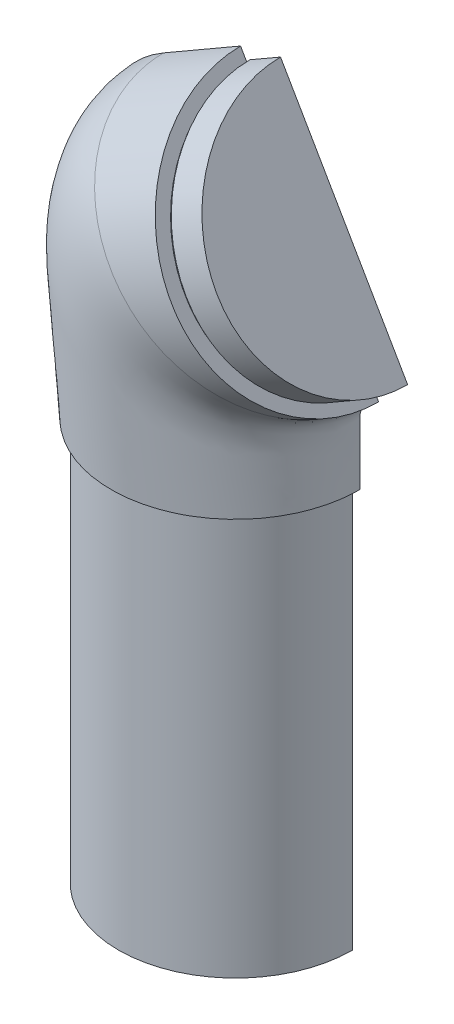
ISO-10303-21;
HEADER;
FILE_DESCRIPTION(('STEP AP214'),'2;1');
FILE_NAME('part.step','',(''),(''),'','','');
FILE_SCHEMA(('AUTOMOTIVE_DESIGN { 1 0 10303 214 1 1 1 1 }'));
ENDSEC;
DATA;
#1=APPLICATION_CONTEXT('core data for automotive mechanical design processes');
#2=APPLICATION_PROTOCOL_DEFINITION('international standard','automotive_design',2000,#1);
#3=PRODUCT_CONTEXT('',#1,'mechanical');
#4=PRODUCT('Part','Part','',(#3));
#5=PRODUCT_RELATED_PRODUCT_CATEGORY('part','',(#4));
#6=PRODUCT_DEFINITION_FORMATION('','',#4);
#7=PRODUCT_DEFINITION_CONTEXT('part definition',#1,'design');
#8=PRODUCT_DEFINITION('design','',#6,#7);
#9=PRODUCT_DEFINITION_SHAPE('','',#8);
#10=(LENGTH_UNIT() NAMED_UNIT(*) SI_UNIT(.MILLI.,.METRE.));
#11=(NAMED_UNIT(*) PLANE_ANGLE_UNIT() SI_UNIT($,.RADIAN.));
#12=(NAMED_UNIT(*) SI_UNIT($,.STERADIAN.) SOLID_ANGLE_UNIT());
#13=UNCERTAINTY_MEASURE_WITH_UNIT(LENGTH_MEASURE(1.E-05),#10,'distance_accuracy_value','');
#14=(GEOMETRIC_REPRESENTATION_CONTEXT(3) GLOBAL_UNCERTAINTY_ASSIGNED_CONTEXT((#13)) GLOBAL_UNIT_ASSIGNED_CONTEXT((#10,
#11,#12)) REPRESENTATION_CONTEXT('',''));
#15=CARTESIAN_POINT('',(0.,0.,0.));
#16=DIRECTION('',(0.,0.,1.));
#17=DIRECTION('',(1.,0.,0.));
#18=AXIS2_PLACEMENT_3D('',#15,#16,#17);
#19=CARTESIAN_POINT('',(0.,0.,0.));
#20=DIRECTION('',(0.,0.,1.));
#21=DIRECTION('',(1.,0.,0.));
#22=AXIS2_PLACEMENT_3D('',#19,#20,#21);
#23=PLANE('',#22);
#24=DIRECTION('',(-1.,0.,0.));
#25=VECTOR('',#24,1.);
#26=CARTESIAN_POINT('',(0.,0.,0.));
#27=LINE('',#26,#25);
#28=CARTESIAN_POINT('',(52.9,0.,0.));
#29=VERTEX_POINT('',#28);
#30=CARTESIAN_POINT('',(-52.9,0.,0.));
#31=VERTEX_POINT('',#30);
#32=EDGE_CURVE('E287',#29,#31,#27,.T.);
#33=ORIENTED_EDGE('',*,*,#32,.T.);
#34=DIRECTION('',(0.,-1.,0.));
#35=VECTOR('',#34,1.);
#36=CARTESIAN_POINT('',(-52.9,0.,0.));
#37=LINE('',#36,#35);
#38=CARTESIAN_POINT('',(-52.9,179.8,0.));
#39=VERTEX_POINT('',#38);
#40=EDGE_CURVE('E292',#31,#39,#37,.F.);
#41=ORIENTED_EDGE('',*,*,#40,.T.);
#42=DIRECTION('',(1.,0.,0.));
#43=VECTOR('',#42,1.);
#44=CARTESIAN_POINT('',(52.9,179.8,0.));
#45=LINE('',#44,#43);
#46=CARTESIAN_POINT('',(-49.9408100461428,179.8,0.));
#47=VERTEX_POINT('',#46);
#48=EDGE_CURVE('E289',#39,#47,#45,.T.);
#49=ORIENTED_EDGE('',*,*,#48,.T.);
#50=DIRECTION('',(0.,-1.,0.));
#51=VECTOR('',#50,1.);
#52=CARTESIAN_POINT('',(-49.9408100461428,0.,0.));
#53=LINE('',#52,#51);
#54=CARTESIAN_POINT('',(-49.9408100461428,182.,0.));
#55=VERTEX_POINT('',#54);
#56=EDGE_CURVE('E57',#47,#55,#53,.F.);
#57=ORIENTED_EDGE('',*,*,#56,.T.);
#58=DIRECTION('',(1.,0.,0.));
#59=VECTOR('',#58,1.);
#60=CARTESIAN_POINT('',(0.,182.,0.));
#61=LINE('',#60,#59);
#62=CARTESIAN_POINT('',(-56.2,182.,0.));
#63=VERTEX_POINT('',#62);
#64=EDGE_CURVE('E65',#55,#63,#61,.F.);
#65=ORIENTED_EDGE('',*,*,#64,.T.);
#66=CARTESIAN_POINT('',(-32.4981395853635,308.709284743092,0.));
#67=CARTESIAN_POINT('',(-43.684502388916,302.250835167208,0.));
#68=CARTESIAN_POINT('',(-52.2381402305011,292.522347205976,0.));
#69=CARTESIAN_POINT('',(-61.3670572465941,272.053546862939,0.));
#70=CARTESIAN_POINT('',(-63.1747268607098,261.882397167296,0.));
#71=CARTESIAN_POINT('',(-60.2471567425906,228.352579644533,0.));
#72=CARTESIAN_POINT('',(-58.2235783712953,205.176289822267,0.));
#73=CARTESIAN_POINT('',(-56.2,182.,0.));
#74=B_SPLINE_CURVE_WITH_KNOTS('',3,(#66,#67,#68,#69,#70,#71,#72,#73),.UNSPECIFIED.,.F.,.F.,(4,2,
2,4),(0.,0.277339745650844,0.500486887933144,1.),.UNSPECIFIED.);
#75=CARTESIAN_POINT('',(-62.2707351138858,251.5288694668,0.));
#76=VERTEX_POINT('',#75);
#77=EDGE_CURVE('E247',#76,#63,#74,.T.);
#78=ORIENTED_EDGE('',*,*,#77,.F.);
#79=CARTESIAN_POINT('',(-32.4981395853635,308.709284743092,0.));
#80=CARTESIAN_POINT('',(-43.684502388916,302.250835167208,0.));
#81=CARTESIAN_POINT('',(-52.2381402305011,292.522347205976,0.));
#82=CARTESIAN_POINT('',(-61.3670572465941,272.053546862939,0.));
#83=CARTESIAN_POINT('',(-63.1747268607098,261.882397167296,0.));
#84=CARTESIAN_POINT('',(-60.2471567425906,228.352579644533,0.));
#85=CARTESIAN_POINT('',(-58.2235783712953,205.176289822267,0.));
#86=CARTESIAN_POINT('',(-56.2,182.,0.));
#87=B_SPLINE_CURVE_WITH_KNOTS('',3,(#79,#80,#81,#82,#83,#84,#85,#86),.UNSPECIFIED.,.F.,.F.,(4,2,
2,4),(0.,0.277339745650844,0.500486887933144,1.),.UNSPECIFIED.);
#88=CARTESIAN_POINT('',(-32.4981395853636,308.709284743092,0.));
#89=VERTEX_POINT('',#88);
#90=EDGE_CURVE('E245',#89,#76,#87,.T.);
#91=ORIENTED_EDGE('',*,*,#90,.F.);
#92=DIRECTION('',(-0.866025403784437,-0.500000000000003,0.));
#93=VECTOR('',#92,1.);
#94=CARTESIAN_POINT('',(-81.7044641670906,280.3,0.));
#95=LINE('',#94,#93);
#96=CARTESIAN_POINT('',(2.29999999999996,328.8,0.));
#97=VERTEX_POINT('',#96);
#98=EDGE_CURVE('E152',#97,#89,#95,.T.);
#99=ORIENTED_EDGE('',*,*,#98,.F.);
#100=DIRECTION('',(-0.500000000000003,0.866025403784437,0.));
#101=VECTOR('',#100,1.);
#102=CARTESIAN_POINT('',(2.29999999999995,328.8,0.));
#103=LINE('',#102,#101);
#104=CARTESIAN_POINT('',(5.4,323.430642496537,0.));
#105=VERTEX_POINT('',#104);
#106=EDGE_CURVE('E163',#105,#97,#103,.T.);
#107=ORIENTED_EDGE('',*,*,#106,.F.);
#108=DIRECTION('',(-0.866025403784437,-0.500000000000003,0.));
#109=VECTOR('',#108,1.);
#110=CARTESIAN_POINT('',(-78.6044641670905,274.930642496536,0.));
#111=LINE('',#110,#109);
#112=CARTESIAN_POINT('',(7.1320508075689,324.430642496536,0.));
#113=VERTEX_POINT('',#112);
#114=EDGE_CURVE('E182',#113,#105,#111,.T.);
#115=ORIENTED_EDGE('',*,*,#114,.F.);
#116=DIRECTION('',(0.500000000000003,-0.866025403784437,0.));
#117=VECTOR('',#116,1.);
#118=CARTESIAN_POINT('',(6.50705080756886,325.513174251267,0.));
#119=LINE('',#118,#117);
#120=CARTESIAN_POINT('',(6.50705080756885,325.513174251267,0.));
#121=VERTEX_POINT('',#120);
#122=EDGE_CURVE('E185',#121,#113,#119,.T.);
#123=ORIENTED_EDGE('',*,*,#122,.F.);
#124=DIRECTION('',(-0.866025403784437,-0.500000000000003,0.));
#125=VECTOR('',#124,1.);
#126=CARTESIAN_POINT('',(-79.2294641670905,276.013174251267,0.));
#127=LINE('',#126,#125);
#128=CARTESIAN_POINT('',(20.3634572681199,333.513174251267,0.));
#129=VERTEX_POINT('',#128);
#130=EDGE_CURVE('E190',#129,#121,#127,.T.);
#131=ORIENTED_EDGE('',*,*,#130,.F.);
#132=DIRECTION('',(-0.500000000000003,0.866025403784437,0.));
#133=VECTOR('',#132,1.);
#134=CARTESIAN_POINT('',(20.3634572681198,333.513174251267,0.));
#135=LINE('',#134,#133);
#136=CARTESIAN_POINT('',(77.8634572681201,233.920252816057,0.));
#137=VERTEX_POINT('',#136);
#138=EDGE_CURVE('E153',#137,#129,#135,.T.);
#139=ORIENTED_EDGE('',*,*,#138,.F.);
#140=DIRECTION('',(-0.866025403784437,-0.500000000000003,0.));
#141=VECTOR('',#140,1.);
#142=CARTESIAN_POINT('',(-21.7294641670903,176.420252816057,0.));
#143=LINE('',#142,#141);
#144=CARTESIAN_POINT('',(64.0070508075691,225.920252816057,0.));
#145=VERTEX_POINT('',#144);
#146=EDGE_CURVE('E187',#145,#137,#143,.F.);
#147=ORIENTED_EDGE('',*,*,#146,.F.);
#148=CARTESIAN_POINT('',(63.3820508075691,227.002784570788,0.));
#149=VERTEX_POINT('',#148);
#150=EDGE_CURVE('E184',#149,#145,#119,.T.);
#151=ORIENTED_EDGE('',*,*,#150,.F.);
#152=DIRECTION('',(-0.866025403784437,-0.500000000000003,0.));
#153=VECTOR('',#152,1.);
#154=CARTESIAN_POINT('',(-22.3544641670903,177.502784570787,0.));
#155=LINE('',#154,#153);
#156=CARTESIAN_POINT('',(61.6500000000002,226.002784570788,0.));
#157=VERTEX_POINT('',#156);
#158=EDGE_CURVE('E159',#157,#149,#155,.F.);
#159=ORIENTED_EDGE('',*,*,#158,.F.);
#160=CARTESIAN_POINT('',(64.7500000000003,220.633427067324,0.));
#161=VERTEX_POINT('',#160);
#162=EDGE_CURVE('E156',#161,#157,#103,.T.);
#163=ORIENTED_EDGE('',*,*,#162,.F.);
#164=DIRECTION('',(-0.866025403784437,-0.500000000000003,0.));
#165=VECTOR('',#164,1.);
#166=CARTESIAN_POINT('',(-19.2544641670902,172.133427067324,0.));
#167=LINE('',#166,#165);
#168=CARTESIAN_POINT('',(61.2,218.583833611701,0.));
#169=VERTEX_POINT('',#168);
#170=EDGE_CURVE('E141',#169,#161,#167,.F.);
#171=ORIENTED_EDGE('',*,*,#170,.F.);
#172=CARTESIAN_POINT('',(56.2,182.,0.));
#173=CARTESIAN_POINT('',(56.2,188.433725967834,0.));
#174=CARTESIAN_POINT('',(56.2,194.867451935668,0.));
#175=CARTESIAN_POINT('',(56.2,204.17531179362,0.));
#176=CARTESIAN_POINT('',(56.1999999999999,207.049445683738,0.));
#177=CARTESIAN_POINT('',(56.2000000000001,213.495713879047,0.));
#178=CARTESIAN_POINT('',(58.1064409459754,216.797766459106,0.));
#179=CARTESIAN_POINT('',(61.2,218.583833611701,0.));
#180=B_SPLINE_CURVE_WITH_KNOTS('',3,(#172,#173,#174,#175,#176,#177,#178,#179),.UNSPECIFIED.,.F.,
.F.,(4,2,2,4),(0.,0.499513112066856,0.722660254349156,1.),.UNSPECIFIED.);
#181=CARTESIAN_POINT('',(56.2,209.923579573856,0.));
#182=VERTEX_POINT('',#181);
#183=EDGE_CURVE('E243',#182,#169,#180,.T.);
#184=ORIENTED_EDGE('',*,*,#183,.F.);
#185=CARTESIAN_POINT('',(56.2,182.,0.));
#186=CARTESIAN_POINT('',(56.2,188.433725967834,0.));
#187=CARTESIAN_POINT('',(56.2,194.867451935668,0.));
#188=CARTESIAN_POINT('',(56.2,204.17531179362,0.));
#189=CARTESIAN_POINT('',(56.1999999999999,207.049445683738,0.));
#190=CARTESIAN_POINT('',(56.2000000000001,213.495713879047,0.));
#191=CARTESIAN_POINT('',(58.1064409459754,216.797766459106,0.));
#192=CARTESIAN_POINT('',(61.2,218.583833611701,0.));
#193=B_SPLINE_CURVE_WITH_KNOTS('',3,(#185,#186,#187,#188,#189,#190,#191,#192),.UNSPECIFIED.,.F.,
.F.,(4,2,2,4),(0.,0.499513112066856,0.722660254349156,1.),.UNSPECIFIED.);
#194=CARTESIAN_POINT('',(56.2,182.,0.));
#195=VERTEX_POINT('',#194);
#196=EDGE_CURVE('E240',#195,#182,#193,.T.);
#197=ORIENTED_EDGE('',*,*,#196,.F.);
#198=CARTESIAN_POINT('',(56.2,182.,0.));
#199=DIRECTION('',(-1.,0.,0.));
#200=VECTOR('',#199,1.);
#201=LINE('',#198,#200);
#202=CARTESIAN_POINT('',(49.9408100461428,182.,0.));
#203=VERTEX_POINT('',#202);
#204=EDGE_CURVE('E234',#195,#203,#201,.T.);
#205=ORIENTED_EDGE('',*,*,#204,.T.);
#206=DIRECTION('',(0.,-1.,0.));
#207=VECTOR('',#206,1.);
#208=CARTESIAN_POINT('',(49.9408100461428,0.,0.));
#209=LINE('',#208,#207);
#210=CARTESIAN_POINT('',(49.9408100461428,179.8,0.));
#211=VERTEX_POINT('',#210);
#212=EDGE_CURVE('E13',#203,#211,#209,.T.);
#213=ORIENTED_EDGE('',*,*,#212,.T.);
#214=CARTESIAN_POINT('',(52.9,179.8,0.));
#215=VERTEX_POINT('',#214);
#216=EDGE_CURVE('E73',#211,#215,#45,.T.);
#217=ORIENTED_EDGE('',*,*,#216,.T.);
#218=DIRECTION('',(0.,-1.,0.));
#219=VECTOR('',#218,1.);
#220=CARTESIAN_POINT('',(52.9,0.,0.));
#221=LINE('',#220,#219);
#222=EDGE_CURVE('E290',#215,#29,#221,.T.);
#223=ORIENTED_EDGE('',*,*,#222,.T.);
#224=EDGE_LOOP('',(#33,#41,#49,#57,#65,#78,#91,#99,#107,#115,#123,#131,#139,#147,#151,#159,#163,
#171,#184,#197,#205,#213,#217,#223));
#225=FACE_BOUND('',#224,.T.);
#226=ADVANCED_FACE('F48',(#225),#23,.F.);
#227=CARTESIAN_POINT('',(0.,0.,0.));
#228=DIRECTION('',(0.,-1.,0.));
#229=DIRECTION('',(0.,0.,-1.));
#230=AXIS2_PLACEMENT_3D('',#227,#228,#229);
#231=PLANE('',#230);
#232=ORIENTED_EDGE('',*,*,#32,.F.);
#233=CARTESIAN_POINT('',(0.,0.,0.));
#234=DIRECTION('',(0.,-1.,0.));
#235=DIRECTION('',(0.,0.,-1.));
#236=AXIS2_PLACEMENT_3D('',#233,#234,#235);
#237=CIRCLE('',#236,52.9);
#238=EDGE_CURVE('E280',#29,#31,#237,.T.);
#239=ORIENTED_EDGE('',*,*,#238,.T.);
#240=EDGE_LOOP('',(#232,#239));
#241=FACE_BOUND('',#240,.T.);
#242=ADVANCED_FACE('F215',(#241),#231,.T.);
#243=CARTESIAN_POINT('',(0.,0.,0.));
#244=DIRECTION('',(0.,-1.,0.));
#245=DIRECTION('',(0.,0.,-1.));
#246=AXIS2_PLACEMENT_3D('',#243,#244,#245);
#247=CYLINDRICAL_SURFACE('',#246,52.9);
#248=ORIENTED_EDGE('',*,*,#40,.F.);
#249=ORIENTED_EDGE('',*,*,#238,.F.);
#250=ORIENTED_EDGE('',*,*,#222,.F.);
#251=CARTESIAN_POINT('',(0.,179.8,0.));
#252=DIRECTION('',(0.,-1.,0.));
#253=DIRECTION('',(0.,0.,-1.));
#254=AXIS2_PLACEMENT_3D('',#251,#252,#253);
#255=CIRCLE('',#254,52.9);
#256=EDGE_CURVE('E277',#215,#39,#255,.T.);
#257=ORIENTED_EDGE('',*,*,#256,.T.);
#258=EDGE_LOOP('',(#248,#249,#250,#257));
#259=FACE_BOUND('',#258,.T.);
#260=ADVANCED_FACE('F299',(#259),#247,.T.);
#261=CARTESIAN_POINT('',(52.9,179.8,0.));
#262=DIRECTION('',(0.,1.,0.));
#263=DIRECTION('',(0.,0.,1.));
#264=AXIS2_PLACEMENT_3D('',#261,#262,#263);
#265=PLANE('',#264);
#266=ORIENTED_EDGE('',*,*,#48,.F.);
#267=ORIENTED_EDGE('',*,*,#256,.F.);
#268=ORIENTED_EDGE('',*,*,#216,.F.);
#269=CARTESIAN_POINT('',(0.,179.8,0.));
#270=DIRECTION('',(0.,-1.,0.));
#271=DIRECTION('',(0.,0.,-1.));
#272=AXIS2_PLACEMENT_3D('',#269,#270,#271);
#273=CIRCLE('',#272,49.9408100461428);
#274=EDGE_CURVE('E275',#211,#47,#273,.T.);
#275=ORIENTED_EDGE('',*,*,#274,.T.);
#276=EDGE_LOOP('',(#266,#267,#268,#275));
#277=FACE_BOUND('',#276,.T.);
#278=ADVANCED_FACE('F297',(#277),#265,.T.);
#279=CARTESIAN_POINT('',(0.,0.,0.));
#280=DIRECTION('',(0.,-1.,0.));
#281=DIRECTION('',(0.,0.,-1.));
#282=AXIS2_PLACEMENT_3D('',#279,#280,#281);
#283=CYLINDRICAL_SURFACE('',#282,49.9408100461428);
#284=ORIENTED_EDGE('',*,*,#56,.F.);
#285=ORIENTED_EDGE('',*,*,#274,.F.);
#286=ORIENTED_EDGE('',*,*,#212,.F.);
#287=CARTESIAN_POINT('',(0.,182.,0.));
#288=DIRECTION('',(0.,-1.,0.));
#289=DIRECTION('',(0.,0.,-1.));
#290=AXIS2_PLACEMENT_3D('',#287,#288,#289);
#291=CIRCLE('',#290,49.9408100461428);
#292=EDGE_CURVE('E238',#203,#55,#291,.T.);
#293=ORIENTED_EDGE('',*,*,#292,.T.);
#294=EDGE_LOOP('',(#284,#285,#286,#293));
#295=FACE_BOUND('',#294,.T.);
#296=ADVANCED_FACE('F214',(#295),#283,.T.);
#297=CARTESIAN_POINT('',(0.,182.,0.));
#298=DIRECTION('',(0.,1.,0.));
#299=DIRECTION('',(0.,0.,1.));
#300=AXIS2_PLACEMENT_3D('',#297,#298,#299);
#301=PLANE('',#300);
#302=ORIENTED_EDGE('',*,*,#292,.F.);
#303=ORIENTED_EDGE('',*,*,#204,.F.);
#304=CARTESIAN_POINT('',(-56.2,182.,0.));
#305=CARTESIAN_POINT('',(-56.2000419790112,182.,1.05362781943592));
#306=CARTESIAN_POINT('',(-56.1704109403865,182.,2.10725513481555));
#307=CARTESIAN_POINT('',(-56.0520082118276,182.,4.21112491673496));
#308=CARTESIAN_POINT('',(-55.9632396953049,182.,5.261367561863));
#309=CARTESIAN_POINT('',(-55.7267697254406,182.,7.35517696486038));
#310=CARTESIAN_POINT('',(-55.5790694532196,182.,8.39874385610049));
#311=CARTESIAN_POINT('',(-55.2253387751618,182.,10.4752049981828));
#312=CARTESIAN_POINT('',(-55.0193485566867,182.,11.5081060956761));
#313=CARTESIAN_POINT('',(-54.5496616794257,182.,13.5606939172889));
#314=CARTESIAN_POINT('',(-54.2859655278743,182.,14.5803807574781));
#315=CARTESIAN_POINT('',(-53.701719967143,182.,16.6033299112941));
#316=CARTESIAN_POINT('',(-53.3811707763197,182.,17.6065922879867));
#317=CARTESIAN_POINT('',(-52.6840632209159,182.,19.5940513208761));
#318=CARTESIAN_POINT('',(-52.3074758621957,182.,20.5782378074909));
#319=CARTESIAN_POINT('',(-51.4996055603357,182.,22.5239131541039));
#320=CARTESIAN_POINT('',(-51.0683219436696,182.,23.4854017344284));
#321=CARTESIAN_POINT('',(-50.1524160738579,182.,25.3826340243548));
#322=CARTESIAN_POINT('',(-49.6677938361401,182.,26.318377741403));
#323=CARTESIAN_POINT('',(-48.6468418841803,182.,28.1609574766155));
#324=CARTESIAN_POINT('',(-48.1105224311597,182.,29.0677991840967));
#325=CARTESIAN_POINT('',(-46.9877269003883,182.,30.849953297122));
#326=CARTESIAN_POINT('',(-46.4012509629416,182.,31.7252657908539));
#327=CARTESIAN_POINT('',(-45.485438323586,182.,33.012324423233));
#328=CARTESIAN_POINT('',(-45.1741535283962,182.,33.4370224402427));
#329=CARTESIAN_POINT('',(-44.539694453636,182.,34.2775961507915));
#330=CARTESIAN_POINT('',(-44.216517571751,182.,34.6934698815653));
#331=CARTESIAN_POINT('',(-43.3941738645376,182.,35.7215088451537));
#332=CARTESIAN_POINT('',(-42.8877659575935,182.,36.3279115685137));
#333=CARTESIAN_POINT('',(-41.8498277668219,182.,37.5188506484814));
#334=CARTESIAN_POINT('',(-41.3182938764645,182.,38.1033838442799));
#335=CARTESIAN_POINT('',(-39.6873230063346,182.,39.8227212801987));
#336=CARTESIAN_POINT('',(-38.5513574908361,182.,40.9234624962857));
#337=CARTESIAN_POINT('',(-36.7812807476143,182.,42.4995811471067));
#338=CARTESIAN_POINT('',(-36.1800894506995,182.,43.0125633368406));
#339=CARTESIAN_POINT('',(-34.9567230588494,182.,44.0126185209007));
#340=CARTESIAN_POINT('',(-34.3345539447987,182.,44.499698799622));
#341=CARTESIAN_POINT('',(-33.0701629607382,182.,45.4472227073932));
#342=CARTESIAN_POINT('',(-32.427939095523,182.,45.9076636730701));
#343=CARTESIAN_POINT('',(-31.1246386440214,182.,46.8010602206081));
#344=CARTESIAN_POINT('',(-30.4635606610362,182.,47.234013758517));
#345=CARTESIAN_POINT('',(-28.4540135674134,182.,48.4903174060614));
#346=CARTESIAN_POINT('',(-27.0787896822933,182.,49.2714414102739));
#347=CARTESIAN_POINT('',(-24.2676214483973,182.,50.7149844095023));
#348=CARTESIAN_POINT('',(-22.831676799033,182.,51.3774028168002));
#349=CARTESIAN_POINT('',(-19.909152302572,182.,52.5789684765177));
#350=CARTESIAN_POINT('',(-18.4225756650874,182.,53.1181235260757));
#351=CARTESIAN_POINT('',(-15.4093168711974,182.,54.0693122251259));
#352=CARTESIAN_POINT('',(-13.8826349151802,182.,54.4813465096525));
#353=CARTESIAN_POINT('',(-10.7995944577358,182.,55.1754042334872));
#354=CARTESIAN_POINT('',(-9.24322869426606,182.,55.4573954220706));
#355=CARTESIAN_POINT('',(-6.11225786331051,182.,55.8891483969149));
#356=CARTESIAN_POINT('',(-4.53765271262459,182.,56.0389095797593));
#357=CARTESIAN_POINT('',(-1.38139866683656,182.,56.2052662344842));
#358=CARTESIAN_POINT('',(0.200250358499066,182.,56.221859233918));
#359=CARTESIAN_POINT('',(3.35932773463149,182.,56.1218211708624));
#360=CARTESIAN_POINT('',(4.93675609891783,182.,56.0051905346767));
#361=CARTESIAN_POINT('',(8.07580039731675,182.,55.63938147861));
#362=CARTESIAN_POINT('',(9.63741991117926,182.,55.390233782413));
#363=CARTESIAN_POINT('',(12.7341072231026,182.,54.7612272010265));
#364=CARTESIAN_POINT('',(14.2691749998093,182.,54.381368210718));
#365=CARTESIAN_POINT('',(17.3018544757594,182.,53.4937029583323));
#366=CARTESIAN_POINT('',(18.7994662736853,182.,52.9858970333863));
#367=CARTESIAN_POINT('',(21.7466157626231,182.,51.8459866668838));
#368=CARTESIAN_POINT('',(23.1961533635123,182.,51.2138819923251));
#369=CARTESIAN_POINT('',(26.0369646224724,182.,49.8297964629609));
#370=CARTESIAN_POINT('',(27.4282336202787,182.,49.077806042844));
#371=CARTESIAN_POINT('',(30.1424624124138,182.,47.4592791330672));
#372=CARTESIAN_POINT('',(31.465422481779,182.,46.5927431046593));
#373=CARTESIAN_POINT('',(34.0335204267451,182.,44.7512900653049));
#374=CARTESIAN_POINT('',(35.2786624834094,182.,43.7763788850523));
#375=CARTESIAN_POINT('',(37.6823724966599,182.,41.7250844099285));
#376=CARTESIAN_POINT('',(38.8409401177239,182.,40.6487007218337));
#377=CARTESIAN_POINT('',(41.0631333558407,182.,38.4025453798181));
#378=CARTESIAN_POINT('',(42.1267786300155,182.,37.2327931567417));
#379=CARTESIAN_POINT('',(44.1518327271902,182.,34.8076289443206));
#380=CARTESIAN_POINT('',(45.1132413869606,182.,33.5522168182178));
#381=CARTESIAN_POINT('',(46.4734021744832,182.,31.6118212128764));
#382=CARTESIAN_POINT('',(46.913248910338,182.,30.9552728332055));
#383=CARTESIAN_POINT('',(47.7648610045401,182.,29.6242183686922));
#384=CARTESIAN_POINT('',(48.1766284315734,182.,28.9497136118509));
#385=CARTESIAN_POINT('',(48.9713007148927,182.,27.5840306219699));
#386=CARTESIAN_POINT('',(49.3542093239005,182.,26.892854572303));
#387=CARTESIAN_POINT('',(50.0906436903046,182.,25.494822454868));
#388=CARTESIAN_POINT('',(50.4441611294457,182.,24.787962019349));
#389=CARTESIAN_POINT('',(51.4598330331098,182.,22.6453122271065));
#390=CARTESIAN_POINT('',(52.0768797807226,182.,21.1878451202906));
#391=CARTESIAN_POINT('',(53.1858588151865,182.,18.2262110997637));
#392=CARTESIAN_POINT('',(53.677807523799,182.,16.722050344699));
#393=CARTESIAN_POINT('',(54.247797073202,182.,14.6934902333447));
#394=CARTESIAN_POINT('',(54.3830653064413,182.,14.1847177659247));
#395=CARTESIAN_POINT('',(54.6392305717616,182.,13.1636733430544));
#396=CARTESIAN_POINT('',(54.7601308139628,182.,12.6514021964336));
#397=CARTESIAN_POINT('',(55.1011507476817,182.,11.1098511176326));
#398=CARTESIAN_POINT('',(55.2996249619149,182.,10.0757078416209));
#399=CARTESIAN_POINT('',(55.6380587392993,182.,7.99843214273239));
#400=CARTESIAN_POINT('',(55.7780486384135,182.,6.95530466728756));
#401=CARTESIAN_POINT('',(55.9405462012446,182.,5.41810513409839));
#402=CARTESIAN_POINT('',(55.9859786813365,182.,4.92636482817217));
#403=CARTESIAN_POINT('',(56.0638580000222,182.,3.94194713823813));
#404=CARTESIAN_POINT('',(56.0963075627073,182.,3.44926997262397));
#405=CARTESIAN_POINT('',(56.1481702555803,182.,2.46404795122433));
#406=CARTESIAN_POINT('',(56.1676047875762,182.,1.97150421613654));
#407=CARTESIAN_POINT('',(56.1935219443287,182.,0.985974229770951));
#408=CARTESIAN_POINT('',(56.2000018919257,182.,0.492987908084236));
#409=CARTESIAN_POINT('',(56.2,182.,0.));
#410=B_SPLINE_CURVE_WITH_KNOTS('',3,(#304,#305,#306,#307,#308,#309,#310,#311,#312,#313,#314,
#315,#316,#317,#318,#319,#320,#321,#322,#323,#324,#325,#326,#327,#328,#329,#330,#331,#332,#333,
#334,#335,#336,#337,#338,#339,#340,#341,#342,#343,#344,#345,#346,#347,#348,#349,#350,#351,#352,
#353,#354,#355,#356,#357,#358,#359,#360,#361,#362,#363,#364,#365,#366,#367,#368,#369,#370,#371,
#372,#373,#374,#375,#376,#377,#378,#379,#380,#381,#382,#383,#384,#385,#386,#387,#388,#389,#390,
#391,#392,#393,#394,#395,#396,#397,#398,#399,#400,#401,#402,#403,#404,#405,#406,#407,#408,#409),
.UNSPECIFIED.,.F.,.F.,(4,2,2,2,2,2,2,2,2,2,2,2,2,2,2,2,2,2,2,2,2,2,2,2,2,2,2,2,2,2,2,2,2,2,2,2,
2,2,2,2,2,2,2,2,2,2,2,2,2,2,2,2,4),(0.,3.1604657826292,6.32076198327544,9.48099484788836,
12.6390542110523,15.7970858160251,18.9551052921429,22.1147644452426,25.2744625099672,
28.4341596607758,31.5932309393817,34.7522933813239,36.3318002372378,37.9116548123492,
40.2810035218243,42.6506933614176,47.3893102459134,49.7596974913478,52.1294145484864,
54.4993681196928,56.8694977136276,61.6081067164799,66.3467391798026,71.0850718135332,
75.8233807764425,80.562864210219,85.302369271978,90.041962328831,94.781540219454,
99.5200197317994,104.258503054871,108.996973892501,113.73545361264,118.474311590749,
123.213150487021,127.9517345522,132.690336980964,137.427955821653,142.165582226244,
144.53580443655,146.905851836473,149.275590508247,151.645997593686,156.388163500004,
161.129706575097,162.708902882641,164.287745697573,167.445040184973,170.600694936239,
172.082059713835,173.563113506482,175.041725846978,176.520643721961),.UNSPECIFIED.);
#411=EDGE_CURVE('E232',#63,#195,#410,.T.);
#412=ORIENTED_EDGE('',*,*,#411,.F.);
#413=ORIENTED_EDGE('',*,*,#64,.F.);
#414=EDGE_LOOP('',(#302,#303,#412,#413));
#415=FACE_BOUND('',#414,.T.);
#416=ADVANCED_FACE('F210',(#415),#301,.F.);
#417=CARTESIAN_POINT('',(-56.2,182.,0.));
#418=CARTESIAN_POINT('',(-58.2235783712953,205.176289822267,0.));
#419=CARTESIAN_POINT('',(-60.2471567425906,228.352579644533,0.));
#420=CARTESIAN_POINT('',(-63.1747268607098,261.882397167296,0.));
#421=CARTESIAN_POINT('',(-61.3670572465941,272.053546862939,0.));
#422=CARTESIAN_POINT('',(-52.2381402305011,292.522347205976,0.));
#423=CARTESIAN_POINT('',(-43.684502388916,302.250835167208,0.));
#424=CARTESIAN_POINT('',(-32.4981395853635,308.709284743092,0.));
#425=CARTESIAN_POINT('',(-56.2,182.,14.9047449008));
#426=CARTESIAN_POINT('',(-57.795451715433,205.031599628038,15.1807352444374));
#427=CARTESIAN_POINT('',(-59.3909034308661,228.063199256076,15.4567255880747));
#428=CARTESIAN_POINT('',(-61.699090172363,261.383689235603,15.8560089043937));
#429=CARTESIAN_POINT('',(-59.9261356175656,271.50539974931,15.9793018770754));
#430=CARTESIAN_POINT('',(-51.2979606884392,292.058617040046,16.2558302501047));
#431=CARTESIAN_POINT('',(-43.1541789989718,301.945884544331,16.4090656504523));
#432=CARTESIAN_POINT('',(-32.4981395853635,308.709284743092,16.5623010508));
#433=CARTESIAN_POINT('',(-50.2786472938953,182.,29.2001549114727));
#434=CARTESIAN_POINT('',(-51.6100181356908,204.09636240793,29.7408525780157));
#435=CARTESIAN_POINT('',(-52.9413889774863,226.19272481586,30.2815502445587));
#436=CARTESIAN_POINT('',(-54.867522181846,258.160179707752,31.0637934005254));
#437=CARTESIAN_POINT('',(-53.202566743627,267.879290521003,31.3053388899492));
#438=CARTESIAN_POINT('',(-45.2394994827519,287.72483660161,31.8470906195907));
#439=CARTESIAN_POINT('',(-37.5966554694268,297.331956009642,32.1472968598084));
#440=CARTESIAN_POINT('',(-27.5620209697873,303.961379191973,32.4475031000261));
#441=CARTESIAN_POINT('',(-29.2001549114727,182.,50.2786472938953));
#442=CARTESIAN_POINT('',(-30.2592332259483,200.992837973338,51.2096542474942));
#443=CARTESIAN_POINT('',(-31.3183115404239,219.985675946675,52.1406612010932));
#444=CARTESIAN_POINT('',(-32.8505111676724,247.46317110958,53.4875762382276));
#445=CARTESIAN_POINT('',(-31.5158582398189,255.826242962579,53.903484321763));
#446=CARTESIAN_POINT('',(-25.1393743396677,273.020992859167,54.8363062269235));
#447=CARTESIAN_POINT('',(-18.6404694256398,281.383201870272,55.3532200485486));
#448=CARTESIAN_POINT('',(-9.99070850095052,287.060056815323,55.8701338701737));
#449=CARTESIAN_POINT('',(-14.9047449008,182.,56.2));
#450=CARTESIAN_POINT('',(-15.9317381117104,198.939598427537,57.2406523168059));
#451=CARTESIAN_POINT('',(-16.9587313226209,215.879196855074,58.2813046336119));
#452=CARTESIAN_POINT('',(-18.4445124904874,240.386210209666,59.7868468301726));
#453=CARTESIAN_POINT('',(-17.3214979868955,247.847237967224,60.2517367099274));
#454=CARTESIAN_POINT('',(-11.8425697892359,263.21413483829,61.2944177264548));
#455=CARTESIAN_POINT('',(-5.97341127790737,270.675458332733,61.8722088632274));
#456=CARTESIAN_POINT('',(1.92613600625599,275.597598840945,62.45));
#457=CARTESIAN_POINT('',(14.9047449008,182.,56.2));
#458=CARTESIAN_POINT('',(13.9081597404151,194.670417362564,57.2406523168059));
#459=CARTESIAN_POINT('',(12.9115745800303,207.340834725128,58.2813046336119));
#460=CARTESIAN_POINT('',(11.4697856297776,225.67149875125,59.7868468301726));
#461=CARTESIAN_POINT('',(12.1544407403013,231.255754579454,60.2517367099274));
#462=CARTESIAN_POINT('',(15.8044295587348,242.803926246733,61.2944177264548));
#463=CARTESIAN_POINT('',(20.3953498349667,248.373143293581,61.8722088632274));
#464=CARTESIAN_POINT('',(26.7757244083804,251.695519513847,62.45));
#465=CARTESIAN_POINT('',(29.2001549114727,182.,50.2786472938952));
#466=CARTESIAN_POINT('',(28.235654854653,192.617177816763,51.2096542474942));
#467=CARTESIAN_POINT('',(27.2711547978333,203.234355633526,52.1406612010932));
#468=CARTESIAN_POINT('',(25.8757843069625,218.594537851336,53.4875762382276));
#469=CARTESIAN_POINT('',(26.3488009932247,223.276749584099,53.903484321763));
#470=CARTESIAN_POINT('',(29.1012341091667,232.997068225856,54.8363062269235));
#471=CARTESIAN_POINT('',(33.0624079826991,237.665399756042,55.3532200485486));
#472=CARTESIAN_POINT('',(38.692568915587,240.233061539469,55.8701338701737));
#473=CARTESIAN_POINT('',(50.2786472938952,182.,29.2001549114726));
#474=CARTESIAN_POINT('',(49.5864397643955,189.513653382171,29.7408525780157));
#475=CARTESIAN_POINT('',(48.8942322348957,197.027306764342,30.2815502445587));
#476=CARTESIAN_POINT('',(47.8927953211362,207.897529253164,31.0637934005254));
#477=CARTESIAN_POINT('',(48.0355094970328,211.223702025674,31.3053388899492));
#478=CARTESIAN_POINT('',(49.2013592522509,218.293224483413,31.8470906195907));
#479=CARTESIAN_POINT('',(52.0185940264862,221.716645616672,32.1472968598084));
#480=CARTESIAN_POINT('',(56.2638813844237,223.33173916282,32.4475031000262));
#481=CARTESIAN_POINT('',(56.2,182.,14.9047449007999));
#482=CARTESIAN_POINT('',(55.7718733441377,188.578416162063,15.1807352444373));
#483=CARTESIAN_POINT('',(55.3437466882755,195.156832324125,15.4567255880747));
#484=CARTESIAN_POINT('',(54.7243633116532,204.674019725313,15.8560089043937));
#485=CARTESIAN_POINT('',(54.7590783709714,207.597592797367,15.9793018770754));
#486=CARTESIAN_POINT('',(55.2598204579382,213.959444044977,16.2558302501047));
#487=CARTESIAN_POINT('',(57.5761175560312,217.102717081983,16.4090656504523));
#488=CARTESIAN_POINT('',(61.2,218.583833611701,16.5623010508001));
#489=CARTESIAN_POINT('',(56.2,182.,0.));
#490=CARTESIAN_POINT('',(56.2,188.433725967834,0.));
#491=CARTESIAN_POINT('',(56.2,194.867451935668,0.));
#492=CARTESIAN_POINT('',(56.2,204.17531179362,0.));
#493=CARTESIAN_POINT('',(56.1999999999999,207.049445683738,0.));
#494=CARTESIAN_POINT('',(56.2000000000001,213.495713879047,0.));
#495=CARTESIAN_POINT('',(58.1064409459754,216.797766459106,0.));
#496=CARTESIAN_POINT('',(61.2,218.583833611701,0.));
#497=B_SPLINE_SURFACE_WITH_KNOTS('',3,3,((#417,#418,#419,#420,#421,#422,#423,#424),(#425,#426,
#427,#428,#429,#430,#431,#432),(#433,#434,#435,#436,#437,#438,#439,#440),(#441,#442,#443,#444,
#445,#446,#447,#448),(#449,#450,#451,#452,#453,#454,#455,#456),(#457,#458,#459,#460,#461,#462,
#463,#464),(#465,#466,#467,#468,#469,#470,#471,#472),(#473,#474,#475,#476,#477,#478,#479,#480),
(#481,#482,#483,#484,#485,#486,#487,#488),(#489,#490,#491,#492,#493,#494,#495,#496)),
.UNSPECIFIED.,.F.,.F.,.F.,(4,2,2,2,4),(4,2,2,4),(0.,0.25,0.5,0.75,1.),(0.,0.499513112066856,
0.722660254349156,1.),.UNSPECIFIED.);
#498=CARTESIAN_POINT('',(61.2,218.583833611701,0.));
#499=CARTESIAN_POINT('',(61.2,218.583833611701,16.5623010508001));
#500=CARTESIAN_POINT('',(56.2638813844237,223.33173916282,32.4475031000262));
#501=CARTESIAN_POINT('',(38.692568915587,240.233061539469,55.8701338701737));
#502=CARTESIAN_POINT('',(26.7757244083804,251.695519513847,62.45));
#503=CARTESIAN_POINT('',(1.92613600625599,275.597598840945,62.45));
#504=CARTESIAN_POINT('',(-9.99070850095052,287.060056815323,55.8701338701737));
#505=CARTESIAN_POINT('',(-27.5620209697873,303.961379191973,32.4475031000261));
#506=CARTESIAN_POINT('',(-32.4981395853635,308.709284743092,16.5623010508));
#507=CARTESIAN_POINT('',(-32.4981395853635,308.709284743092,0.));
#508=B_SPLINE_CURVE_WITH_KNOTS('',3,(#498,#499,#500,#501,#502,#503,#504,#505,#506,#507),
.UNSPECIFIED.,.F.,.F.,(4,2,2,2,4),(0.,0.25,0.5,0.75,1.),.UNSPECIFIED.);
#509=EDGE_CURVE('E148',#89,#169,#508,.F.);
#510=ORIENTED_EDGE('',*,*,#411,.T.);
#511=ORIENTED_EDGE('',*,*,#196,.T.);
#512=ORIENTED_EDGE('',*,*,#183,.T.);
#513=ORIENTED_EDGE('',*,*,#509,.F.);
#514=ORIENTED_EDGE('',*,*,#90,.T.);
#515=ORIENTED_EDGE('',*,*,#77,.T.);
#516=EDGE_LOOP('',(#510,#511,#512,#513,#514,#515));
#517=FACE_BOUND('',#516,.T.);
#518=ADVANCED_FACE('F208',(#517),#497,.T.);
#519=CARTESIAN_POINT('',(-50.4794641670904,226.216713533662,0.));
#520=DIRECTION('',(-0.866025403784437,-0.500000000000003,0.));
#521=DIRECTION('',(0.500000000000003,-0.866025403784437,0.));
#522=AXIS2_PLACEMENT_3D('',#519,#520,#521);
#523=CYLINDRICAL_SURFACE('',#522,62.45);
#524=ORIENTED_EDGE('',*,*,#98,.T.);
#525=ORIENTED_EDGE('',*,*,#509,.T.);
#526=ORIENTED_EDGE('',*,*,#170,.T.);
#527=CARTESIAN_POINT('',(33.5250000000001,274.716713533662,0.));
#528=DIRECTION('',(-0.866025403784437,-0.500000000000003,0.));
#529=DIRECTION('',(0.500000000000003,-0.866025403784437,0.));
#530=AXIS2_PLACEMENT_3D('',#527,#528,#529);
#531=CIRCLE('',#530,62.4499999999999);
#532=EDGE_CURVE('E146',#161,#97,#531,.T.);
#533=ORIENTED_EDGE('',*,*,#532,.T.);
#534=EDGE_LOOP('',(#524,#525,#526,#533));
#535=FACE_BOUND('',#534,.T.);
#536=ADVANCED_FACE('F144',(#535),#523,.T.);
#537=CARTESIAN_POINT('',(20.3634572681198,333.513174251267,0.));
#538=DIRECTION('',(-0.866025403784437,-0.500000000000003,0.));
#539=DIRECTION('',(0.500000000000003,-0.866025403784437,0.));
#540=AXIS2_PLACEMENT_3D('',#537,#538,#539);
#541=PLANE('',#540);
#542=CARTESIAN_POINT('',(49.11345726812,283.716713533662,0.));
#543=DIRECTION('',(-0.866025403784437,-0.500000000000003,0.));
#544=DIRECTION('',(0.500000000000003,-0.866025403784437,0.));
#545=AXIS2_PLACEMENT_3D('',#542,#543,#544);
#546=CIRCLE('',#545,57.4999999999998);
#547=EDGE_CURVE('E178',#137,#129,#546,.T.);
#548=ORIENTED_EDGE('',*,*,#547,.F.);
#549=ORIENTED_EDGE('',*,*,#138,.T.);
#550=EDGE_LOOP('',(#548,#549));
#551=FACE_BOUND('',#550,.T.);
#552=ADVANCED_FACE('F207',(#551),#541,.F.);
#553=CARTESIAN_POINT('',(-50.4794641670904,226.216713533662,0.));
#554=DIRECTION('',(-0.866025403784437,-0.500000000000003,0.));
#555=DIRECTION('',(0.500000000000003,-0.866025403784437,0.));
#556=AXIS2_PLACEMENT_3D('',#553,#554,#555);
#557=CYLINDRICAL_SURFACE('',#556,57.4999999999998);
#558=ORIENTED_EDGE('',*,*,#547,.T.);
#559=ORIENTED_EDGE('',*,*,#130,.T.);
#560=CARTESIAN_POINT('',(35.257050807569,275.716713533662,0.));
#561=DIRECTION('',(-0.866025403784437,-0.500000000000003,0.));
#562=DIRECTION('',(0.500000000000003,-0.866025403784437,0.));
#563=AXIS2_PLACEMENT_3D('',#560,#561,#562);
#564=CIRCLE('',#563,57.4999999999998);
#565=EDGE_CURVE('E175',#145,#121,#564,.T.);
#566=ORIENTED_EDGE('',*,*,#565,.F.);
#567=ORIENTED_EDGE('',*,*,#146,.T.);
#568=EDGE_LOOP('',(#558,#559,#566,#567));
#569=FACE_BOUND('',#568,.T.);
#570=ADVANCED_FACE('F337',(#569),#557,.T.);
#571=CARTESIAN_POINT('',(6.50705080756886,325.513174251267,0.));
#572=DIRECTION('',(0.866025403784437,0.500000000000003,0.));
#573=DIRECTION('',(-0.500000000000003,0.866025403784437,0.));
#574=AXIS2_PLACEMENT_3D('',#571,#572,#573);
#575=PLANE('',#574);
#576=ORIENTED_EDGE('',*,*,#565,.T.);
#577=ORIENTED_EDGE('',*,*,#122,.T.);
#578=CARTESIAN_POINT('',(35.257050807569,275.716713533662,0.));
#579=DIRECTION('',(-0.866025403784437,-0.500000000000003,0.));
#580=DIRECTION('',(0.500000000000003,-0.866025403784437,0.));
#581=AXIS2_PLACEMENT_3D('',#578,#579,#580);
#582=CIRCLE('',#581,56.2499999999998);
#583=EDGE_CURVE('E170',#149,#113,#582,.T.);
#584=ORIENTED_EDGE('',*,*,#583,.F.);
#585=ORIENTED_EDGE('',*,*,#150,.T.);
#586=EDGE_LOOP('',(#576,#577,#584,#585));
#587=FACE_BOUND('',#586,.T.);
#588=ADVANCED_FACE('F344',(#587),#575,.F.);
#589=CARTESIAN_POINT('',(-50.4794641670904,226.216713533662,0.));
#590=DIRECTION('',(-0.866025403784437,-0.500000000000003,0.));
#591=DIRECTION('',(0.500000000000003,-0.866025403784437,0.));
#592=AXIS2_PLACEMENT_3D('',#589,#590,#591);
#593=CYLINDRICAL_SURFACE('',#592,56.2499999999998);
#594=ORIENTED_EDGE('',*,*,#583,.T.);
#595=ORIENTED_EDGE('',*,*,#114,.T.);
#596=CARTESIAN_POINT('',(33.5250000000001,274.716713533662,0.));
#597=DIRECTION('',(-0.866025403784437,-0.500000000000003,0.));
#598=DIRECTION('',(0.500000000000003,-0.866025403784437,0.));
#599=AXIS2_PLACEMENT_3D('',#596,#597,#598);
#600=CIRCLE('',#599,56.2499999999998);
#601=EDGE_CURVE('E168',#157,#105,#600,.T.);
#602=ORIENTED_EDGE('',*,*,#601,.F.);
#603=ORIENTED_EDGE('',*,*,#158,.T.);
#604=EDGE_LOOP('',(#594,#595,#602,#603));
#605=FACE_BOUND('',#604,.T.);
#606=ADVANCED_FACE('F350',(#605),#593,.T.);
#607=CARTESIAN_POINT('',(2.29999999999995,328.8,0.));
#608=DIRECTION('',(-0.866025403784437,-0.500000000000003,0.));
#609=DIRECTION('',(0.500000000000003,-0.866025403784437,0.));
#610=AXIS2_PLACEMENT_3D('',#607,#608,#609);
#611=PLANE('',#610);
#612=ORIENTED_EDGE('',*,*,#532,.F.);
#613=ORIENTED_EDGE('',*,*,#162,.T.);
#614=ORIENTED_EDGE('',*,*,#601,.T.);
#615=ORIENTED_EDGE('',*,*,#106,.T.);
#616=EDGE_LOOP('',(#612,#613,#614,#615));
#617=FACE_BOUND('',#616,.T.);
#618=ADVANCED_FACE('F165',(#617),#611,.F.);
#619=CLOSED_SHELL('',(#226,#242,#260,#278,#296,#416,#518,#536,#552,#570,#588,#606,#618));
#620=MANIFOLD_SOLID_BREP('B2',#619);
#621=ADVANCED_BREP_SHAPE_REPRESENTATION('',(#18,#620),#14);
#622=SHAPE_DEFINITION_REPRESENTATION(#9,#621);
ENDSEC;
END-ISO-10303-21;
